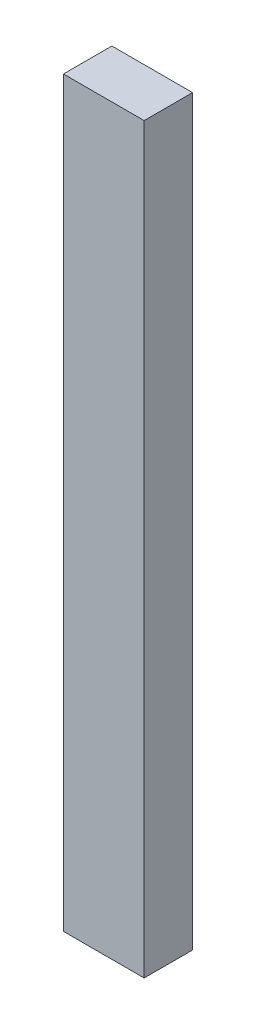
ISO-10303-21;
HEADER;
FILE_DESCRIPTION(('STEP AP214'),'2;1');
FILE_NAME('part.step','',(''),(''),'','','');
FILE_SCHEMA(('AUTOMOTIVE_DESIGN { 1 0 10303 214 1 1 1 1 }'));
ENDSEC;
DATA;
#1=APPLICATION_CONTEXT('core data for automotive mechanical design processes');
#2=APPLICATION_PROTOCOL_DEFINITION('international standard','automotive_design',2000,#1);
#3=PRODUCT_CONTEXT('',#1,'mechanical');
#4=PRODUCT('Part','Part','',(#3));
#5=PRODUCT_RELATED_PRODUCT_CATEGORY('part','',(#4));
#6=PRODUCT_DEFINITION_FORMATION('','',#4);
#7=PRODUCT_DEFINITION_CONTEXT('part definition',#1,'design');
#8=PRODUCT_DEFINITION('design','',#6,#7);
#9=PRODUCT_DEFINITION_SHAPE('','',#8);
#10=(LENGTH_UNIT() NAMED_UNIT(*) SI_UNIT(.MILLI.,.METRE.));
#11=(NAMED_UNIT(*) PLANE_ANGLE_UNIT() SI_UNIT($,.RADIAN.));
#12=(NAMED_UNIT(*) SI_UNIT($,.STERADIAN.) SOLID_ANGLE_UNIT());
#13=UNCERTAINTY_MEASURE_WITH_UNIT(LENGTH_MEASURE(1.E-05),#10,'distance_accuracy_value','');
#14=(GEOMETRIC_REPRESENTATION_CONTEXT(3) GLOBAL_UNCERTAINTY_ASSIGNED_CONTEXT((#13)) GLOBAL_UNIT_ASSIGNED_CONTEXT((#10,
#11,#12)) REPRESENTATION_CONTEXT('',''));
#15=CARTESIAN_POINT('',(0.,0.,0.));
#16=DIRECTION('',(0.,0.,1.));
#17=DIRECTION('',(1.,0.,0.));
#18=AXIS2_PLACEMENT_3D('',#15,#16,#17);
#19=CARTESIAN_POINT('',(0.25,4.6,-0.15));
#20=DIRECTION('',(-1.,0.,0.));
#21=DIRECTION('',(0.,0.,1.));
#22=AXIS2_PLACEMENT_3D('',#19,#20,#21);
#23=PLANE('',#22);
#24=DIRECTION('',(0.,0.,-1.));
#25=VECTOR('',#24,1.);
#26=CARTESIAN_POINT('',(0.25,0.,-0.15));
#27=LINE('',#26,#25);
#28=CARTESIAN_POINT('',(0.25,0.,0.15));
#29=VERTEX_POINT('',#28);
#30=CARTESIAN_POINT('',(0.25,0.,-0.15));
#31=VERTEX_POINT('',#30);
#32=EDGE_CURVE('E97',#29,#31,#27,.T.);
#33=ORIENTED_EDGE('',*,*,#32,.T.);
#34=DIRECTION('',(0.,-1.,0.));
#35=VECTOR('',#34,1.);
#36=CARTESIAN_POINT('',(0.25,4.6,-0.15));
#37=LINE('',#36,#35);
#38=CARTESIAN_POINT('',(0.25,4.6,-0.15));
#39=VERTEX_POINT('',#38);
#40=EDGE_CURVE('E11',#39,#31,#37,.T.);
#41=ORIENTED_EDGE('',*,*,#40,.F.);
#42=DIRECTION('',(0.,0.,-1.));
#43=VECTOR('',#42,1.);
#44=CARTESIAN_POINT('',(0.25,4.6,-0.15));
#45=LINE('',#44,#43);
#46=CARTESIAN_POINT('',(0.25,4.6,0.15));
#47=VERTEX_POINT('',#46);
#48=EDGE_CURVE('E85',#47,#39,#45,.T.);
#49=ORIENTED_EDGE('',*,*,#48,.F.);
#50=DIRECTION('',(0.,-1.,0.));
#51=VECTOR('',#50,1.);
#52=CARTESIAN_POINT('',(0.25,4.6,0.15));
#53=LINE('',#52,#51);
#54=EDGE_CURVE('E93',#47,#29,#53,.T.);
#55=ORIENTED_EDGE('',*,*,#54,.T.);
#56=EDGE_LOOP('',(#33,#41,#49,#55));
#57=FACE_BOUND('',#56,.T.);
#58=ADVANCED_FACE('F34',(#57),#23,.F.);
#59=CARTESIAN_POINT('',(-0.25,4.6,-0.15));
#60=DIRECTION('',(0.,0.,1.));
#61=DIRECTION('',(1.,0.,0.));
#62=AXIS2_PLACEMENT_3D('',#59,#60,#61);
#63=PLANE('',#62);
#64=DIRECTION('',(-1.,0.,0.));
#65=VECTOR('',#64,1.);
#66=CARTESIAN_POINT('',(-0.25,0.,-0.15));
#67=LINE('',#66,#65);
#68=CARTESIAN_POINT('',(-0.25,0.,-0.15));
#69=VERTEX_POINT('',#68);
#70=EDGE_CURVE('E89',#31,#69,#67,.T.);
#71=ORIENTED_EDGE('',*,*,#70,.T.);
#72=DIRECTION('',(0.,-1.,0.));
#73=VECTOR('',#72,1.);
#74=CARTESIAN_POINT('',(-0.25,4.6,-0.15));
#75=LINE('',#74,#73);
#76=CARTESIAN_POINT('',(-0.25,4.6,-0.15));
#77=VERTEX_POINT('',#76);
#78=EDGE_CURVE('E42',#77,#69,#75,.T.);
#79=ORIENTED_EDGE('',*,*,#78,.F.);
#80=DIRECTION('',(-1.,0.,0.));
#81=VECTOR('',#80,1.);
#82=CARTESIAN_POINT('',(-0.25,4.6,-0.15));
#83=LINE('',#82,#81);
#84=EDGE_CURVE('E80',#39,#77,#83,.T.);
#85=ORIENTED_EDGE('',*,*,#84,.F.);
#86=ORIENTED_EDGE('',*,*,#40,.T.);
#87=EDGE_LOOP('',(#71,#79,#85,#86));
#88=FACE_BOUND('',#87,.T.);
#89=ADVANCED_FACE('F88',(#88),#63,.F.);
#90=CARTESIAN_POINT('',(-0.25,4.6,-0.15));
#91=DIRECTION('',(1.,0.,0.));
#92=DIRECTION('',(0.,0.,-1.));
#93=AXIS2_PLACEMENT_3D('',#90,#91,#92);
#94=PLANE('',#93);
#95=DIRECTION('',(0.,0.,1.));
#96=VECTOR('',#95,1.);
#97=CARTESIAN_POINT('',(-0.25,0.,-0.15));
#98=LINE('',#97,#96);
#99=CARTESIAN_POINT('',(-0.25,0.,0.15));
#100=VERTEX_POINT('',#99);
#101=EDGE_CURVE('E67',#69,#100,#98,.T.);
#102=ORIENTED_EDGE('',*,*,#101,.T.);
#103=DIRECTION('',(0.,-1.,0.));
#104=VECTOR('',#103,1.);
#105=CARTESIAN_POINT('',(-0.25,4.6,0.15));
#106=LINE('',#105,#104);
#107=CARTESIAN_POINT('',(-0.25,4.6,0.15));
#108=VERTEX_POINT('',#107);
#109=EDGE_CURVE('E90',#108,#100,#106,.T.);
#110=ORIENTED_EDGE('',*,*,#109,.F.);
#111=DIRECTION('',(0.,0.,1.));
#112=VECTOR('',#111,1.);
#113=CARTESIAN_POINT('',(-0.25,4.6,-0.15));
#114=LINE('',#113,#112);
#115=EDGE_CURVE('E83',#77,#108,#114,.T.);
#116=ORIENTED_EDGE('',*,*,#115,.F.);
#117=ORIENTED_EDGE('',*,*,#78,.T.);
#118=EDGE_LOOP('',(#102,#110,#116,#117));
#119=FACE_BOUND('',#118,.T.);
#120=ADVANCED_FACE('F91',(#119),#94,.F.);
#121=CARTESIAN_POINT('',(-0.25,4.6,0.15));
#122=DIRECTION('',(0.,0.,-1.));
#123=DIRECTION('',(-1.,0.,0.));
#124=AXIS2_PLACEMENT_3D('',#121,#122,#123);
#125=PLANE('',#124);
#126=DIRECTION('',(1.,0.,0.));
#127=VECTOR('',#126,1.);
#128=CARTESIAN_POINT('',(-0.25,0.,0.15));
#129=LINE('',#128,#127);
#130=EDGE_CURVE('E73',#100,#29,#129,.T.);
#131=ORIENTED_EDGE('',*,*,#130,.T.);
#132=ORIENTED_EDGE('',*,*,#54,.F.);
#133=DIRECTION('',(1.,0.,0.));
#134=VECTOR('',#133,1.);
#135=CARTESIAN_POINT('',(-0.25,4.6,0.15));
#136=LINE('',#135,#134);
#137=EDGE_CURVE('E50',#108,#47,#136,.T.);
#138=ORIENTED_EDGE('',*,*,#137,.F.);
#139=ORIENTED_EDGE('',*,*,#109,.T.);
#140=EDGE_LOOP('',(#131,#132,#138,#139));
#141=FACE_BOUND('',#140,.T.);
#142=ADVANCED_FACE('F104',(#141),#125,.F.);
#143=CARTESIAN_POINT('',(0.,4.6,0.));
#144=DIRECTION('',(0.,1.,0.));
#145=DIRECTION('',(0.,0.,1.));
#146=AXIS2_PLACEMENT_3D('',#143,#144,#145);
#147=PLANE('',#146);
#148=ORIENTED_EDGE('',*,*,#48,.T.);
#149=ORIENTED_EDGE('',*,*,#84,.T.);
#150=ORIENTED_EDGE('',*,*,#115,.T.);
#151=ORIENTED_EDGE('',*,*,#137,.T.);
#152=EDGE_LOOP('',(#148,#149,#150,#151));
#153=FACE_BOUND('',#152,.T.);
#154=ADVANCED_FACE('F81',(#153),#147,.T.);
#155=CARTESIAN_POINT('',(0.,0.,0.));
#156=DIRECTION('',(0.,1.,0.));
#157=DIRECTION('',(0.,0.,1.));
#158=AXIS2_PLACEMENT_3D('',#155,#156,#157);
#159=PLANE('',#158);
#160=ORIENTED_EDGE('',*,*,#32,.F.);
#161=ORIENTED_EDGE('',*,*,#130,.F.);
#162=ORIENTED_EDGE('',*,*,#101,.F.);
#163=ORIENTED_EDGE('',*,*,#70,.F.);
#164=EDGE_LOOP('',(#160,#161,#162,#163));
#165=FACE_BOUND('',#164,.T.);
#166=ADVANCED_FACE('F107',(#165),#159,.F.);
#167=CLOSED_SHELL('',(#58,#89,#120,#142,#154,#166));
#168=MANIFOLD_SOLID_BREP('B2',#167);
#169=ADVANCED_BREP_SHAPE_REPRESENTATION('',(#18,#168),#14);
#170=SHAPE_DEFINITION_REPRESENTATION(#9,#169);
ENDSEC;
END-ISO-10303-21;
